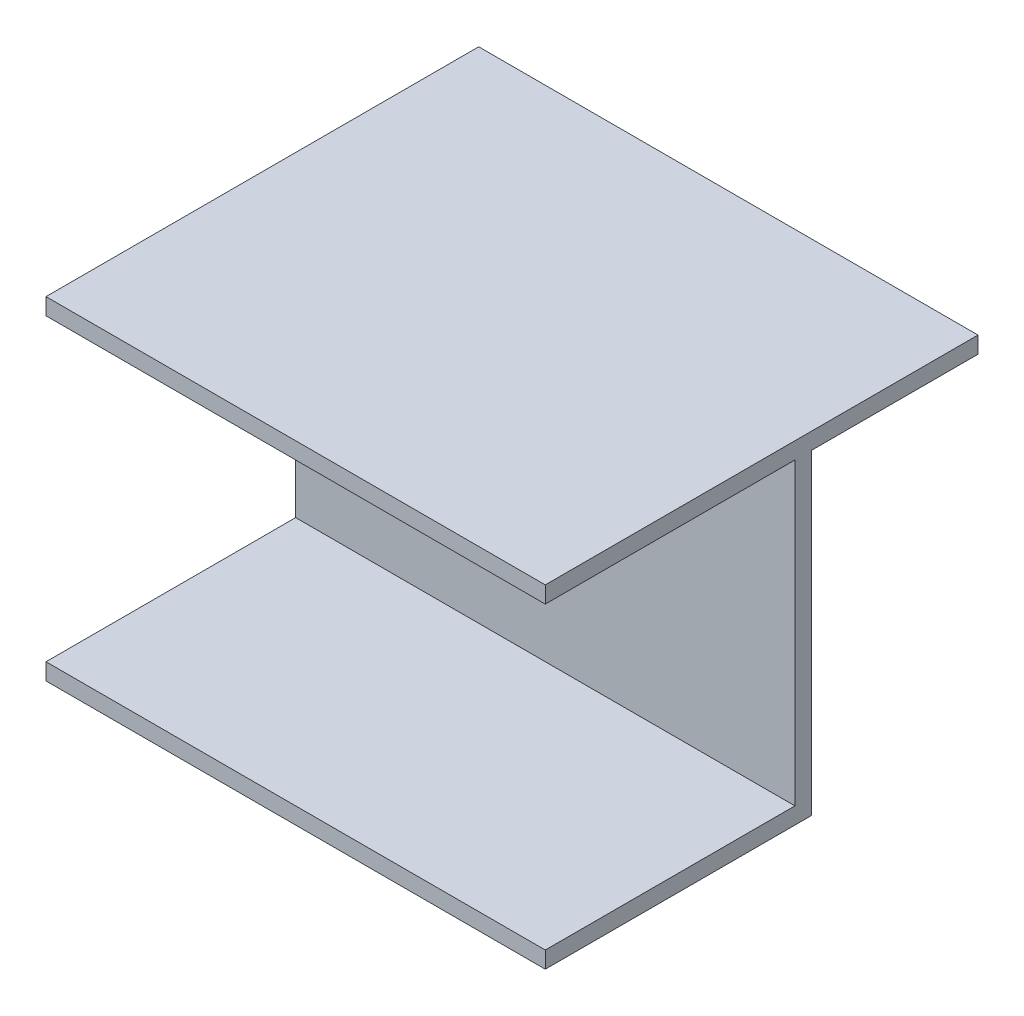
ISO-10303-21;
HEADER;
FILE_DESCRIPTION(('STEP AP214'),'2;1');
FILE_NAME('part.step','',(''),(''),'','','');
FILE_SCHEMA(('AUTOMOTIVE_DESIGN { 1 0 10303 214 1 1 1 1 }'));
ENDSEC;
DATA;
#1=APPLICATION_CONTEXT('core data for automotive mechanical design processes');
#2=APPLICATION_PROTOCOL_DEFINITION('international standard','automotive_design',2000,#1);
#3=PRODUCT_CONTEXT('',#1,'mechanical');
#4=PRODUCT('Part','Part','',(#3));
#5=PRODUCT_RELATED_PRODUCT_CATEGORY('part','',(#4));
#6=PRODUCT_DEFINITION_FORMATION('','',#4);
#7=PRODUCT_DEFINITION_CONTEXT('part definition',#1,'design');
#8=PRODUCT_DEFINITION('design','',#6,#7);
#9=PRODUCT_DEFINITION_SHAPE('','',#8);
#10=(LENGTH_UNIT() NAMED_UNIT(*) SI_UNIT(.MILLI.,.METRE.));
#11=(NAMED_UNIT(*) PLANE_ANGLE_UNIT() SI_UNIT($,.RADIAN.));
#12=(NAMED_UNIT(*) SI_UNIT($,.STERADIAN.) SOLID_ANGLE_UNIT());
#13=UNCERTAINTY_MEASURE_WITH_UNIT(LENGTH_MEASURE(1.E-05),#10,'distance_accuracy_value','');
#14=(GEOMETRIC_REPRESENTATION_CONTEXT(3) GLOBAL_UNCERTAINTY_ASSIGNED_CONTEXT((#13)) GLOBAL_UNIT_ASSIGNED_CONTEXT((#10,
#11,#12)) REPRESENTATION_CONTEXT('',''));
#15=CARTESIAN_POINT('',(0.,0.,0.));
#16=DIRECTION('',(0.,0.,1.));
#17=DIRECTION('',(1.,0.,0.));
#18=AXIS2_PLACEMENT_3D('',#15,#16,#17);
#19=CARTESIAN_POINT('',(0.,0.,0.));
#20=DIRECTION('',(0.,0.,1.));
#21=DIRECTION('',(1.,0.,0.));
#22=AXIS2_PLACEMENT_3D('',#19,#20,#21);
#23=PLANE('',#22);
#24=DIRECTION('',(-1.,0.,0.));
#25=VECTOR('',#24,1.);
#26=CARTESIAN_POINT('',(28.421052631579,11.421052631579,0.));
#27=LINE('',#26,#25);
#28=CARTESIAN_POINT('',(28.421052631579,11.421052631579,0.));
#29=VERTEX_POINT('',#28);
#30=CARTESIAN_POINT('',(-31.5789473684211,11.421052631579,0.));
#31=VERTEX_POINT('',#30);
#32=EDGE_CURVE('E61',#29,#31,#27,.T.);
#33=ORIENTED_EDGE('',*,*,#32,.F.);
#34=DIRECTION('',(0.,1.,0.));
#35=VECTOR('',#34,1.);
#36=CARTESIAN_POINT('',(28.421052631579,13.421052631579,0.));
#37=LINE('',#36,#35);
#38=CARTESIAN_POINT('',(28.421052631579,-26.578947368421,0.));
#39=VERTEX_POINT('',#38);
#40=EDGE_CURVE('E148',#39,#29,#37,.T.);
#41=ORIENTED_EDGE('',*,*,#40,.F.);
#42=DIRECTION('',(1.,0.,0.));
#43=VECTOR('',#42,1.);
#44=CARTESIAN_POINT('',(-31.578947368421,-26.578947368421,0.));
#45=LINE('',#44,#43);
#46=CARTESIAN_POINT('',(-31.578947368421,-26.578947368421,0.));
#47=VERTEX_POINT('',#46);
#48=EDGE_CURVE('E216',#47,#39,#45,.T.);
#49=ORIENTED_EDGE('',*,*,#48,.F.);
#50=DIRECTION('',(0.,-1.,0.));
#51=VECTOR('',#50,1.);
#52=CARTESIAN_POINT('',(-31.5789473684211,13.421052631579,0.));
#53=LINE('',#52,#51);
#54=EDGE_CURVE('E186',#31,#47,#53,.T.);
#55=ORIENTED_EDGE('',*,*,#54,.F.);
#56=EDGE_LOOP('',(#33,#41,#49,#55));
#57=FACE_BOUND('',#56,.T.);
#58=ADVANCED_FACE('F45',(#57),#23,.F.);
#59=CARTESIAN_POINT('',(-31.5789473684211,13.421052631579,2.));
#60=DIRECTION('',(1.,0.,0.));
#61=DIRECTION('',(0.,1.,0.));
#62=AXIS2_PLACEMENT_3D('',#59,#60,#61);
#63=PLANE('',#62);
#64=DIRECTION('',(0.,0.,-1.));
#65=VECTOR('',#64,1.);
#66=CARTESIAN_POINT('',(-31.5789473684211,13.421052631579,2.));
#67=LINE('',#66,#65);
#68=CARTESIAN_POINT('',(-31.5789473684211,13.421052631579,32.));
#69=VERTEX_POINT('',#68);
#70=CARTESIAN_POINT('',(-31.5789473684211,13.421052631579,-20.));
#71=VERTEX_POINT('',#70);
#72=EDGE_CURVE('E213',#69,#71,#67,.T.);
#73=ORIENTED_EDGE('',*,*,#72,.T.);
#74=DIRECTION('',(0.,1.,0.));
#75=VECTOR('',#74,1.);
#76=CARTESIAN_POINT('',(-31.5789473684211,13.421052631579,-20.));
#77=LINE('',#76,#75);
#78=CARTESIAN_POINT('',(-31.5789473684211,11.421052631579,-20.));
#79=VERTEX_POINT('',#78);
#80=EDGE_CURVE('E135',#79,#71,#77,.T.);
#81=ORIENTED_EDGE('',*,*,#80,.F.);
#82=DIRECTION('',(0.,0.,1.));
#83=VECTOR('',#82,1.);
#84=CARTESIAN_POINT('',(-31.5789473684211,11.421052631579,-20.));
#85=LINE('',#84,#83);
#86=EDGE_CURVE('E130',#79,#31,#85,.T.);
#87=ORIENTED_EDGE('',*,*,#86,.T.);
#88=ORIENTED_EDGE('',*,*,#54,.T.);
#89=DIRECTION('',(0.,0.,-1.));
#90=VECTOR('',#89,1.);
#91=CARTESIAN_POINT('',(-31.578947368421,-26.578947368421,2.));
#92=LINE('',#91,#90);
#93=CARTESIAN_POINT('',(-31.5789473684211,-26.578947368421,32.));
#94=VERTEX_POINT('',#93);
#95=EDGE_CURVE('E11',#94,#47,#92,.T.);
#96=ORIENTED_EDGE('',*,*,#95,.F.);
#97=DIRECTION('',(0.,-1.,0.));
#98=VECTOR('',#97,1.);
#99=CARTESIAN_POINT('',(-31.5789473684211,-26.578947368421,32.));
#100=LINE('',#99,#98);
#101=CARTESIAN_POINT('',(-31.5789473684211,-24.5789473684211,32.));
#102=VERTEX_POINT('',#101);
#103=EDGE_CURVE('E194',#102,#94,#100,.T.);
#104=ORIENTED_EDGE('',*,*,#103,.F.);
#105=DIRECTION('',(0.,0.,-1.));
#106=VECTOR('',#105,1.);
#107=CARTESIAN_POINT('',(-31.5789473684211,-24.5789473684211,32.));
#108=LINE('',#107,#106);
#109=CARTESIAN_POINT('',(-31.5789473684211,-24.5789473684211,2.));
#110=VERTEX_POINT('',#109);
#111=EDGE_CURVE('E155',#102,#110,#108,.T.);
#112=ORIENTED_EDGE('',*,*,#111,.T.);
#113=DIRECTION('',(0.,-1.,0.));
#114=VECTOR('',#113,1.);
#115=CARTESIAN_POINT('',(-31.5789473684211,13.421052631579,2.));
#116=LINE('',#115,#114);
#117=CARTESIAN_POINT('',(-31.5789473684211,11.421052631579,2.));
#118=VERTEX_POINT('',#117);
#119=EDGE_CURVE('E207',#118,#110,#116,.T.);
#120=ORIENTED_EDGE('',*,*,#119,.F.);
#121=DIRECTION('',(0.,0.,-1.));
#122=VECTOR('',#121,1.);
#123=CARTESIAN_POINT('',(-31.5789473684211,11.421052631579,32.));
#124=LINE('',#123,#122);
#125=CARTESIAN_POINT('',(-31.5789473684211,11.421052631579,32.));
#126=VERTEX_POINT('',#125);
#127=EDGE_CURVE('E183',#126,#118,#124,.T.);
#128=ORIENTED_EDGE('',*,*,#127,.F.);
#129=DIRECTION('',(0.,-1.,0.));
#130=VECTOR('',#129,1.);
#131=CARTESIAN_POINT('',(-31.5789473684211,13.421052631579,32.));
#132=LINE('',#131,#130);
#133=EDGE_CURVE('E160',#69,#126,#132,.T.);
#134=ORIENTED_EDGE('',*,*,#133,.F.);
#135=EDGE_LOOP('',(#73,#81,#87,#88,#96,#104,#112,#120,#128,#134));
#136=FACE_BOUND('',#135,.T.);
#137=ADVANCED_FACE('F47',(#136),#63,.F.);
#138=CARTESIAN_POINT('',(-31.578947368421,-26.578947368421,2.));
#139=DIRECTION('',(0.,1.,0.));
#140=DIRECTION('',(0.,0.,1.));
#141=AXIS2_PLACEMENT_3D('',#138,#139,#140);
#142=PLANE('',#141);
#143=ORIENTED_EDGE('',*,*,#48,.T.);
#144=DIRECTION('',(0.,0.,-1.));
#145=VECTOR('',#144,1.);
#146=CARTESIAN_POINT('',(28.421052631579,-26.578947368421,2.));
#147=LINE('',#146,#145);
#148=CARTESIAN_POINT('',(28.421052631579,-26.578947368421,32.));
#149=VERTEX_POINT('',#148);
#150=EDGE_CURVE('E54',#149,#39,#147,.T.);
#151=ORIENTED_EDGE('',*,*,#150,.F.);
#152=DIRECTION('',(1.,0.,0.));
#153=VECTOR('',#152,1.);
#154=CARTESIAN_POINT('',(-31.5789473684211,-26.578947368421,32.));
#155=LINE('',#154,#153);
#156=EDGE_CURVE('E200',#94,#149,#155,.T.);
#157=ORIENTED_EDGE('',*,*,#156,.F.);
#158=ORIENTED_EDGE('',*,*,#95,.T.);
#159=EDGE_LOOP('',(#143,#151,#157,#158));
#160=FACE_BOUND('',#159,.T.);
#161=ADVANCED_FACE('F231',(#160),#142,.F.);
#162=CARTESIAN_POINT('',(28.421052631579,13.421052631579,2.));
#163=DIRECTION('',(-1.,0.,0.));
#164=DIRECTION('',(0.,-1.,0.));
#165=AXIS2_PLACEMENT_3D('',#162,#163,#164);
#166=PLANE('',#165);
#167=ORIENTED_EDGE('',*,*,#40,.T.);
#168=DIRECTION('',(0.,0.,1.));
#169=VECTOR('',#168,1.);
#170=CARTESIAN_POINT('',(28.421052631579,11.421052631579,-20.));
#171=LINE('',#170,#169);
#172=CARTESIAN_POINT('',(28.421052631579,11.421052631579,-20.));
#173=VERTEX_POINT('',#172);
#174=EDGE_CURVE('E128',#173,#29,#171,.T.);
#175=ORIENTED_EDGE('',*,*,#174,.F.);
#176=DIRECTION('',(0.,-1.,0.));
#177=VECTOR('',#176,1.);
#178=CARTESIAN_POINT('',(28.421052631579,13.421052631579,-20.));
#179=LINE('',#178,#177);
#180=CARTESIAN_POINT('',(28.421052631579,13.421052631579,-20.));
#181=VERTEX_POINT('',#180);
#182=EDGE_CURVE('E136',#181,#173,#179,.T.);
#183=ORIENTED_EDGE('',*,*,#182,.F.);
#184=DIRECTION('',(0.,0.,-1.));
#185=VECTOR('',#184,1.);
#186=CARTESIAN_POINT('',(28.421052631579,13.421052631579,2.));
#187=LINE('',#186,#185);
#188=CARTESIAN_POINT('',(28.421052631579,13.421052631579,32.));
#189=VERTEX_POINT('',#188);
#190=EDGE_CURVE('E223',#189,#181,#187,.T.);
#191=ORIENTED_EDGE('',*,*,#190,.F.);
#192=DIRECTION('',(0.,1.,0.));
#193=VECTOR('',#192,1.);
#194=CARTESIAN_POINT('',(28.421052631579,13.421052631579,32.));
#195=LINE('',#194,#193);
#196=CARTESIAN_POINT('',(28.421052631579,11.421052631579,32.));
#197=VERTEX_POINT('',#196);
#198=EDGE_CURVE('E168',#197,#189,#195,.T.);
#199=ORIENTED_EDGE('',*,*,#198,.F.);
#200=DIRECTION('',(0.,0.,-1.));
#201=VECTOR('',#200,1.);
#202=CARTESIAN_POINT('',(28.421052631579,11.421052631579,32.));
#203=LINE('',#202,#201);
#204=CARTESIAN_POINT('',(28.421052631579,11.421052631579,2.));
#205=VERTEX_POINT('',#204);
#206=EDGE_CURVE('E176',#197,#205,#203,.T.);
#207=ORIENTED_EDGE('',*,*,#206,.T.);
#208=DIRECTION('',(0.,1.,0.));
#209=VECTOR('',#208,1.);
#210=CARTESIAN_POINT('',(28.421052631579,13.421052631579,2.));
#211=LINE('',#210,#209);
#212=CARTESIAN_POINT('',(28.421052631579,-24.5789473684211,2.));
#213=VERTEX_POINT('',#212);
#214=EDGE_CURVE('E210',#213,#205,#211,.T.);
#215=ORIENTED_EDGE('',*,*,#214,.F.);
#216=DIRECTION('',(0.,0.,-1.));
#217=VECTOR('',#216,1.);
#218=CARTESIAN_POINT('',(28.421052631579,-24.5789473684211,32.));
#219=LINE('',#218,#217);
#220=CARTESIAN_POINT('',(28.421052631579,-24.5789473684211,32.));
#221=VERTEX_POINT('',#220);
#222=EDGE_CURVE('E150',#221,#213,#219,.T.);
#223=ORIENTED_EDGE('',*,*,#222,.F.);
#224=DIRECTION('',(0.,1.,0.));
#225=VECTOR('',#224,1.);
#226=CARTESIAN_POINT('',(28.421052631579,-26.578947368421,32.));
#227=LINE('',#226,#225);
#228=EDGE_CURVE('E197',#149,#221,#227,.T.);
#229=ORIENTED_EDGE('',*,*,#228,.F.);
#230=ORIENTED_EDGE('',*,*,#150,.T.);
#231=EDGE_LOOP('',(#167,#175,#183,#191,#199,#207,#215,#223,#229,#230));
#232=FACE_BOUND('',#231,.T.);
#233=ADVANCED_FACE('F146',(#232),#166,.F.);
#234=CARTESIAN_POINT('',(-31.5789473684211,13.421052631579,2.));
#235=DIRECTION('',(0.,-1.,0.));
#236=DIRECTION('',(0.,0.,-1.));
#237=AXIS2_PLACEMENT_3D('',#234,#235,#236);
#238=PLANE('',#237);
#239=ORIENTED_EDGE('',*,*,#190,.T.);
#240=DIRECTION('',(1.,0.,0.));
#241=VECTOR('',#240,1.);
#242=CARTESIAN_POINT('',(28.421052631579,13.421052631579,-20.));
#243=LINE('',#242,#241);
#244=EDGE_CURVE('E142',#71,#181,#243,.T.);
#245=ORIENTED_EDGE('',*,*,#244,.F.);
#246=ORIENTED_EDGE('',*,*,#72,.F.);
#247=DIRECTION('',(-1.,0.,0.));
#248=VECTOR('',#247,1.);
#249=CARTESIAN_POINT('',(-31.5789473684211,13.421052631579,32.));
#250=LINE('',#249,#248);
#251=EDGE_CURVE('E172',#189,#69,#250,.T.);
#252=ORIENTED_EDGE('',*,*,#251,.F.);
#253=EDGE_LOOP('',(#239,#245,#246,#252));
#254=FACE_BOUND('',#253,.T.);
#255=ADVANCED_FACE('F241',(#254),#238,.F.);
#256=CARTESIAN_POINT('',(0.,0.,2.));
#257=DIRECTION('',(0.,0.,1.));
#258=DIRECTION('',(1.,0.,0.));
#259=AXIS2_PLACEMENT_3D('',#256,#257,#258);
#260=PLANE('',#259);
#261=DIRECTION('',(1.,0.,0.));
#262=VECTOR('',#261,1.);
#263=CARTESIAN_POINT('',(-31.5789473684211,11.421052631579,2.));
#264=LINE('',#263,#262);
#265=EDGE_CURVE('E165',#118,#205,#264,.T.);
#266=ORIENTED_EDGE('',*,*,#265,.F.);
#267=ORIENTED_EDGE('',*,*,#119,.T.);
#268=DIRECTION('',(-1.,0.,0.));
#269=VECTOR('',#268,1.);
#270=CARTESIAN_POINT('',(-31.5789473684211,-24.5789473684211,2.));
#271=LINE('',#270,#269);
#272=EDGE_CURVE('E69',#213,#110,#271,.T.);
#273=ORIENTED_EDGE('',*,*,#272,.F.);
#274=ORIENTED_EDGE('',*,*,#214,.T.);
#275=EDGE_LOOP('',(#266,#267,#273,#274));
#276=FACE_BOUND('',#275,.T.);
#277=ADVANCED_FACE('F263',(#276),#260,.T.);
#278=CARTESIAN_POINT('',(-31.5789473684211,-24.5789473684211,32.));
#279=DIRECTION('',(0.,-1.,0.));
#280=DIRECTION('',(0.,0.,-1.));
#281=AXIS2_PLACEMENT_3D('',#278,#279,#280);
#282=PLANE('',#281);
#283=ORIENTED_EDGE('',*,*,#272,.T.);
#284=ORIENTED_EDGE('',*,*,#111,.F.);
#285=DIRECTION('',(-1.,0.,0.));
#286=VECTOR('',#285,1.);
#287=CARTESIAN_POINT('',(-31.5789473684211,-24.5789473684211,32.));
#288=LINE('',#287,#286);
#289=EDGE_CURVE('E191',#221,#102,#288,.T.);
#290=ORIENTED_EDGE('',*,*,#289,.F.);
#291=ORIENTED_EDGE('',*,*,#222,.T.);
#292=EDGE_LOOP('',(#283,#284,#290,#291));
#293=FACE_BOUND('',#292,.T.);
#294=ADVANCED_FACE('F252',(#293),#282,.F.);
#295=CARTESIAN_POINT('',(0.,0.,32.));
#296=DIRECTION('',(0.,0.,-1.));
#297=DIRECTION('',(-1.,0.,0.));
#298=AXIS2_PLACEMENT_3D('',#295,#296,#297);
#299=PLANE('',#298);
#300=ORIENTED_EDGE('',*,*,#103,.T.);
#301=ORIENTED_EDGE('',*,*,#156,.T.);
#302=ORIENTED_EDGE('',*,*,#228,.T.);
#303=ORIENTED_EDGE('',*,*,#289,.T.);
#304=EDGE_LOOP('',(#300,#301,#302,#303));
#305=FACE_BOUND('',#304,.T.);
#306=ADVANCED_FACE('F255',(#305),#299,.F.);
#307=CARTESIAN_POINT('',(-31.5789473684211,11.421052631579,32.));
#308=DIRECTION('',(0.,1.,0.));
#309=DIRECTION('',(0.,0.,1.));
#310=AXIS2_PLACEMENT_3D('',#307,#308,#309);
#311=PLANE('',#310);
#312=ORIENTED_EDGE('',*,*,#265,.T.);
#313=ORIENTED_EDGE('',*,*,#206,.F.);
#314=DIRECTION('',(1.,0.,0.));
#315=VECTOR('',#314,1.);
#316=CARTESIAN_POINT('',(-31.5789473684211,11.421052631579,32.));
#317=LINE('',#316,#315);
#318=EDGE_CURVE('E164',#126,#197,#317,.T.);
#319=ORIENTED_EDGE('',*,*,#318,.F.);
#320=ORIENTED_EDGE('',*,*,#127,.T.);
#321=EDGE_LOOP('',(#312,#313,#319,#320));
#322=FACE_BOUND('',#321,.T.);
#323=ADVANCED_FACE('F249',(#322),#311,.F.);
#324=CARTESIAN_POINT('',(0.,0.,32.));
#325=DIRECTION('',(0.,0.,1.));
#326=DIRECTION('',(1.,0.,0.));
#327=AXIS2_PLACEMENT_3D('',#324,#325,#326);
#328=PLANE('',#327);
#329=ORIENTED_EDGE('',*,*,#133,.T.);
#330=ORIENTED_EDGE('',*,*,#318,.T.);
#331=ORIENTED_EDGE('',*,*,#198,.T.);
#332=ORIENTED_EDGE('',*,*,#251,.T.);
#333=EDGE_LOOP('',(#329,#330,#331,#332));
#334=FACE_BOUND('',#333,.T.);
#335=ADVANCED_FACE('F245',(#334),#328,.T.);
#336=CARTESIAN_POINT('',(28.421052631579,11.421052631579,-20.));
#337=DIRECTION('',(0.,1.,0.));
#338=DIRECTION('',(0.,0.,1.));
#339=AXIS2_PLACEMENT_3D('',#336,#337,#338);
#340=PLANE('',#339);
#341=ORIENTED_EDGE('',*,*,#32,.T.);
#342=ORIENTED_EDGE('',*,*,#86,.F.);
#343=DIRECTION('',(-1.,0.,0.));
#344=VECTOR('',#343,1.);
#345=CARTESIAN_POINT('',(28.421052631579,11.421052631579,-20.));
#346=LINE('',#345,#344);
#347=EDGE_CURVE('E124',#173,#79,#346,.T.);
#348=ORIENTED_EDGE('',*,*,#347,.F.);
#349=ORIENTED_EDGE('',*,*,#174,.T.);
#350=EDGE_LOOP('',(#341,#342,#348,#349));
#351=FACE_BOUND('',#350,.T.);
#352=ADVANCED_FACE('F126',(#351),#340,.F.);
#353=CARTESIAN_POINT('',(0.,0.,-20.));
#354=DIRECTION('',(0.,0.,-1.));
#355=DIRECTION('',(-1.,0.,0.));
#356=AXIS2_PLACEMENT_3D('',#353,#354,#355);
#357=PLANE('',#356);
#358=ORIENTED_EDGE('',*,*,#182,.T.);
#359=ORIENTED_EDGE('',*,*,#347,.T.);
#360=ORIENTED_EDGE('',*,*,#80,.T.);
#361=ORIENTED_EDGE('',*,*,#244,.T.);
#362=EDGE_LOOP('',(#358,#359,#360,#361));
#363=FACE_BOUND('',#362,.T.);
#364=ADVANCED_FACE('F140',(#363),#357,.T.);
#365=CLOSED_SHELL('',(#58,#137,#161,#233,#255,#277,#294,#306,#323,#335,#352,#364));
#366=MANIFOLD_SOLID_BREP('B2',#365);
#367=ADVANCED_BREP_SHAPE_REPRESENTATION('',(#18,#366),#14);
#368=SHAPE_DEFINITION_REPRESENTATION(#9,#367);
ENDSEC;
END-ISO-10303-21;
